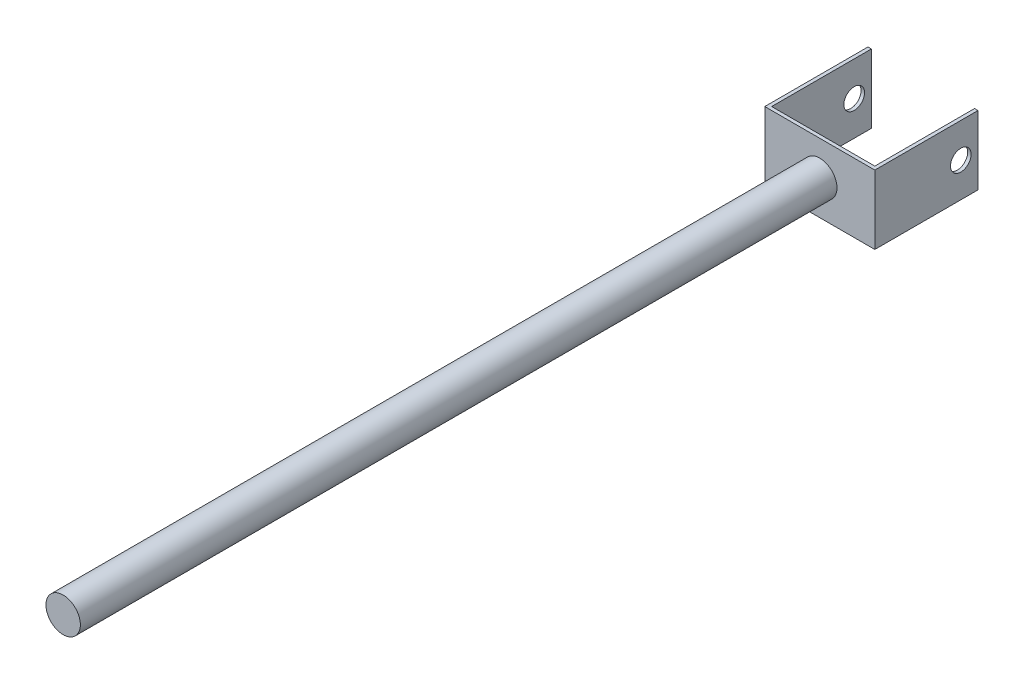
ISO-10303-21;
HEADER;
FILE_DESCRIPTION(('STEP AP214'),'2;1');
FILE_NAME('part.step','',(''),(''),'','','');
FILE_SCHEMA(('AUTOMOTIVE_DESIGN { 1 0 10303 214 1 1 1 1 }'));
ENDSEC;
DATA;
#1=APPLICATION_CONTEXT('core data for automotive mechanical design processes');
#2=APPLICATION_PROTOCOL_DEFINITION('international standard','automotive_design',2000,#1);
#3=PRODUCT_CONTEXT('',#1,'mechanical');
#4=PRODUCT('Part','Part','',(#3));
#5=PRODUCT_RELATED_PRODUCT_CATEGORY('part','',(#4));
#6=PRODUCT_DEFINITION_FORMATION('','',#4);
#7=PRODUCT_DEFINITION_CONTEXT('part definition',#1,'design');
#8=PRODUCT_DEFINITION('design','',#6,#7);
#9=PRODUCT_DEFINITION_SHAPE('','',#8);
#10=(LENGTH_UNIT() NAMED_UNIT(*) SI_UNIT(.MILLI.,.METRE.));
#11=(NAMED_UNIT(*) PLANE_ANGLE_UNIT() SI_UNIT($,.RADIAN.));
#12=(NAMED_UNIT(*) SI_UNIT($,.STERADIAN.) SOLID_ANGLE_UNIT());
#13=UNCERTAINTY_MEASURE_WITH_UNIT(LENGTH_MEASURE(1.E-05),#10,'distance_accuracy_value','');
#14=(GEOMETRIC_REPRESENTATION_CONTEXT(3) GLOBAL_UNCERTAINTY_ASSIGNED_CONTEXT((#13)) GLOBAL_UNIT_ASSIGNED_CONTEXT((#10,
#11,#12)) REPRESENTATION_CONTEXT('',''));
#15=CARTESIAN_POINT('',(0.,0.,0.));
#16=DIRECTION('',(0.,0.,1.));
#17=DIRECTION('',(1.,0.,0.));
#18=AXIS2_PLACEMENT_3D('',#15,#16,#17);
#19=CARTESIAN_POINT('',(80.,50.,-150.));
#20=DIRECTION('',(-1.,0.,0.));
#21=DIRECTION('',(0.,0.,1.));
#22=AXIS2_PLACEMENT_3D('',#19,#20,#21);
#23=PLANE('',#22);
#24=CARTESIAN_POINT('',(80.,0.,-125.));
#25=DIRECTION('',(1.,0.,0.));
#26=DIRECTION('',(0.,0.,-1.));
#27=AXIS2_PLACEMENT_3D('',#24,#25,#26);
#28=CIRCLE('',#27,15.);
#29=CARTESIAN_POINT('',(80.,0.,-140.));
#30=VERTEX_POINT('',#29);
#31=EDGE_CURVE('E231',#30,#30,#28,.T.);
#32=ORIENTED_EDGE('',*,*,#31,.F.);
#33=EDGE_LOOP('',(#32));
#34=FACE_BOUND('',#33,.T.);
#35=DIRECTION('',(0.,0.,-1.));
#36=VECTOR('',#35,1.);
#37=CARTESIAN_POINT('',(80.,-50.,-150.));
#38=LINE('',#37,#36);
#39=CARTESIAN_POINT('',(80.,-50.,0.));
#40=VERTEX_POINT('',#39);
#41=CARTESIAN_POINT('',(80.,-50.,-150.));
#42=VERTEX_POINT('',#41);
#43=EDGE_CURVE('E152',#40,#42,#38,.T.);
#44=ORIENTED_EDGE('',*,*,#43,.T.);
#45=DIRECTION('',(0.,-1.,0.));
#46=VECTOR('',#45,1.);
#47=CARTESIAN_POINT('',(80.,50.,-150.));
#48=LINE('',#47,#46);
#49=CARTESIAN_POINT('',(80.,50.,-150.));
#50=VERTEX_POINT('',#49);
#51=EDGE_CURVE('E187',#50,#42,#48,.T.);
#52=ORIENTED_EDGE('',*,*,#51,.F.);
#53=DIRECTION('',(0.,0.,-1.));
#54=VECTOR('',#53,1.);
#55=CARTESIAN_POINT('',(80.,50.,-150.));
#56=LINE('',#55,#54);
#57=CARTESIAN_POINT('',(80.,50.,0.));
#58=VERTEX_POINT('',#57);
#59=EDGE_CURVE('E108',#58,#50,#56,.T.);
#60=ORIENTED_EDGE('',*,*,#59,.F.);
#61=DIRECTION('',(0.,-1.,0.));
#62=VECTOR('',#61,1.);
#63=CARTESIAN_POINT('',(80.,50.,0.));
#64=LINE('',#63,#62);
#65=EDGE_CURVE('E48',#58,#40,#64,.T.);
#66=ORIENTED_EDGE('',*,*,#65,.T.);
#67=EDGE_LOOP('',(#44,#52,#60,#66));
#68=FACE_BOUND('',#67,.T.);
#69=ADVANCED_FACE('F45',(#34,#68),#23,.F.);
#70=CARTESIAN_POINT('',(75.,50.,-150.));
#71=DIRECTION('',(0.,0.,1.));
#72=DIRECTION('',(1.,0.,0.));
#73=AXIS2_PLACEMENT_3D('',#70,#71,#72);
#74=PLANE('',#73);
#75=DIRECTION('',(-1.,0.,0.));
#76=VECTOR('',#75,1.);
#77=CARTESIAN_POINT('',(75.,-50.,-150.));
#78=LINE('',#77,#76);
#79=CARTESIAN_POINT('',(75.,-50.,-150.));
#80=VERTEX_POINT('',#79);
#81=EDGE_CURVE('E155',#42,#80,#78,.T.);
#82=ORIENTED_EDGE('',*,*,#81,.T.);
#83=DIRECTION('',(0.,-1.,0.));
#84=VECTOR('',#83,1.);
#85=CARTESIAN_POINT('',(75.,50.,-150.));
#86=LINE('',#85,#84);
#87=CARTESIAN_POINT('',(75.,50.,-150.));
#88=VERTEX_POINT('',#87);
#89=EDGE_CURVE('E184',#88,#80,#86,.T.);
#90=ORIENTED_EDGE('',*,*,#89,.F.);
#91=DIRECTION('',(-1.,0.,0.));
#92=VECTOR('',#91,1.);
#93=CARTESIAN_POINT('',(75.,50.,-150.));
#94=LINE('',#93,#92);
#95=EDGE_CURVE('E209',#50,#88,#94,.T.);
#96=ORIENTED_EDGE('',*,*,#95,.F.);
#97=ORIENTED_EDGE('',*,*,#51,.T.);
#98=EDGE_LOOP('',(#82,#90,#96,#97));
#99=FACE_BOUND('',#98,.T.);
#100=ADVANCED_FACE('F202',(#99),#74,.F.);
#101=CARTESIAN_POINT('',(75.,50.,-4.99999999999998));
#102=DIRECTION('',(1.,0.,0.));
#103=DIRECTION('',(0.,0.,-1.));
#104=AXIS2_PLACEMENT_3D('',#101,#102,#103);
#105=PLANE('',#104);
#106=CARTESIAN_POINT('',(75.,0.,-125.));
#107=DIRECTION('',(1.,0.,0.));
#108=DIRECTION('',(0.,0.,-1.));
#109=AXIS2_PLACEMENT_3D('',#106,#107,#108);
#110=CIRCLE('',#109,15.);
#111=CARTESIAN_POINT('',(75.,0.,-140.));
#112=VERTEX_POINT('',#111);
#113=EDGE_CURVE('E222',#112,#112,#110,.T.);
#114=ORIENTED_EDGE('',*,*,#113,.T.);
#115=EDGE_LOOP('',(#114));
#116=FACE_BOUND('',#115,.T.);
#117=DIRECTION('',(0.,0.,1.));
#118=VECTOR('',#117,1.);
#119=CARTESIAN_POINT('',(75.,-50.,-4.99999999999998));
#120=LINE('',#119,#118);
#121=CARTESIAN_POINT('',(75.,-50.,-4.99999999999998));
#122=VERTEX_POINT('',#121);
#123=EDGE_CURVE('E159',#80,#122,#120,.T.);
#124=ORIENTED_EDGE('',*,*,#123,.T.);
#125=DIRECTION('',(0.,-1.,0.));
#126=VECTOR('',#125,1.);
#127=CARTESIAN_POINT('',(75.,50.,-4.99999999999998));
#128=LINE('',#127,#126);
#129=CARTESIAN_POINT('',(75.,50.,-4.99999999999998));
#130=VERTEX_POINT('',#129);
#131=EDGE_CURVE('E180',#130,#122,#128,.T.);
#132=ORIENTED_EDGE('',*,*,#131,.F.);
#133=DIRECTION('',(0.,0.,1.));
#134=VECTOR('',#133,1.);
#135=CARTESIAN_POINT('',(75.,50.,-4.99999999999998));
#136=LINE('',#135,#134);
#137=EDGE_CURVE('E207',#88,#130,#136,.T.);
#138=ORIENTED_EDGE('',*,*,#137,.F.);
#139=ORIENTED_EDGE('',*,*,#89,.T.);
#140=EDGE_LOOP('',(#124,#132,#138,#139));
#141=FACE_BOUND('',#140,.T.);
#142=ADVANCED_FACE('F205',(#116,#141),#105,.F.);
#143=CARTESIAN_POINT('',(-75.,50.,-4.99999999999998));
#144=DIRECTION('',(0.,0.,1.));
#145=DIRECTION('',(1.,0.,0.));
#146=AXIS2_PLACEMENT_3D('',#143,#144,#145);
#147=PLANE('',#146);
#148=DIRECTION('',(-1.,0.,0.));
#149=VECTOR('',#148,1.);
#150=CARTESIAN_POINT('',(-75.,-50.,-4.99999999999998));
#151=LINE('',#150,#149);
#152=CARTESIAN_POINT('',(-75.,-50.,-4.99999999999998));
#153=VERTEX_POINT('',#152);
#154=EDGE_CURVE('E162',#122,#153,#151,.T.);
#155=ORIENTED_EDGE('',*,*,#154,.T.);
#156=DIRECTION('',(0.,-1.,0.));
#157=VECTOR('',#156,1.);
#158=CARTESIAN_POINT('',(-75.,50.,-4.99999999999998));
#159=LINE('',#158,#157);
#160=CARTESIAN_POINT('',(-75.,50.,-4.99999999999998));
#161=VERTEX_POINT('',#160);
#162=EDGE_CURVE('E139',#161,#153,#159,.T.);
#163=ORIENTED_EDGE('',*,*,#162,.F.);
#164=DIRECTION('',(-1.,0.,0.));
#165=VECTOR('',#164,1.);
#166=CARTESIAN_POINT('',(-75.,50.,-4.99999999999998));
#167=LINE('',#166,#165);
#168=EDGE_CURVE('E128',#130,#161,#167,.T.);
#169=ORIENTED_EDGE('',*,*,#168,.F.);
#170=ORIENTED_EDGE('',*,*,#131,.T.);
#171=EDGE_LOOP('',(#155,#163,#169,#170));
#172=FACE_BOUND('',#171,.T.);
#173=ADVANCED_FACE('F250',(#172),#147,.F.);
#174=CARTESIAN_POINT('',(-75.,50.,-150.));
#175=DIRECTION('',(-1.,0.,0.));
#176=DIRECTION('',(0.,0.,1.));
#177=AXIS2_PLACEMENT_3D('',#174,#175,#176);
#178=PLANE('',#177);
#179=CARTESIAN_POINT('',(-75.,0.,-125.));
#180=DIRECTION('',(-1.,0.,0.));
#181=DIRECTION('',(0.,0.,1.));
#182=AXIS2_PLACEMENT_3D('',#179,#180,#181);
#183=CIRCLE('',#182,15.);
#184=CARTESIAN_POINT('',(-75.,0.,-110.));
#185=VERTEX_POINT('',#184);
#186=EDGE_CURVE('E226',#185,#185,#183,.T.);
#187=ORIENTED_EDGE('',*,*,#186,.T.);
#188=EDGE_LOOP('',(#187));
#189=FACE_BOUND('',#188,.T.);
#190=DIRECTION('',(0.,0.,-1.));
#191=VECTOR('',#190,1.);
#192=CARTESIAN_POINT('',(-75.,-50.,-150.));
#193=LINE('',#192,#191);
#194=CARTESIAN_POINT('',(-75.,-50.,-150.));
#195=VERTEX_POINT('',#194);
#196=EDGE_CURVE('E137',#153,#195,#193,.T.);
#197=ORIENTED_EDGE('',*,*,#196,.T.);
#198=DIRECTION('',(0.,-1.,0.));
#199=VECTOR('',#198,1.);
#200=CARTESIAN_POINT('',(-75.,50.,-150.));
#201=LINE('',#200,#199);
#202=CARTESIAN_POINT('',(-75.,50.,-150.));
#203=VERTEX_POINT('',#202);
#204=EDGE_CURVE('E134',#203,#195,#201,.T.);
#205=ORIENTED_EDGE('',*,*,#204,.F.);
#206=DIRECTION('',(0.,0.,-1.));
#207=VECTOR('',#206,1.);
#208=CARTESIAN_POINT('',(-75.,50.,-150.));
#209=LINE('',#208,#207);
#210=EDGE_CURVE('E122',#161,#203,#209,.T.);
#211=ORIENTED_EDGE('',*,*,#210,.F.);
#212=ORIENTED_EDGE('',*,*,#162,.T.);
#213=EDGE_LOOP('',(#197,#205,#211,#212));
#214=FACE_BOUND('',#213,.T.);
#215=ADVANCED_FACE('F135',(#189,#214),#178,.F.);
#216=CARTESIAN_POINT('',(-80.,50.,-150.));
#217=DIRECTION('',(0.,0.,1.));
#218=DIRECTION('',(1.,0.,0.));
#219=AXIS2_PLACEMENT_3D('',#216,#217,#218);
#220=PLANE('',#219);
#221=DIRECTION('',(-1.,0.,0.));
#222=VECTOR('',#221,1.);
#223=CARTESIAN_POINT('',(-80.,-50.,-150.));
#224=LINE('',#223,#222);
#225=CARTESIAN_POINT('',(-80.,-50.,-150.));
#226=VERTEX_POINT('',#225);
#227=EDGE_CURVE('E93',#195,#226,#224,.T.);
#228=ORIENTED_EDGE('',*,*,#227,.T.);
#229=DIRECTION('',(0.,-1.,0.));
#230=VECTOR('',#229,1.);
#231=CARTESIAN_POINT('',(-80.,50.,-150.));
#232=LINE('',#231,#230);
#233=CARTESIAN_POINT('',(-80.,50.,-150.));
#234=VERTEX_POINT('',#233);
#235=EDGE_CURVE('E140',#234,#226,#232,.T.);
#236=ORIENTED_EDGE('',*,*,#235,.F.);
#237=DIRECTION('',(-1.,0.,0.));
#238=VECTOR('',#237,1.);
#239=CARTESIAN_POINT('',(-80.,50.,-150.));
#240=LINE('',#239,#238);
#241=EDGE_CURVE('E126',#203,#234,#240,.T.);
#242=ORIENTED_EDGE('',*,*,#241,.F.);
#243=ORIENTED_EDGE('',*,*,#204,.T.);
#244=EDGE_LOOP('',(#228,#236,#242,#243));
#245=FACE_BOUND('',#244,.T.);
#246=ADVANCED_FACE('F142',(#245),#220,.F.);
#247=CARTESIAN_POINT('',(-80.,50.,0.));
#248=DIRECTION('',(1.,0.,0.));
#249=DIRECTION('',(0.,0.,-1.));
#250=AXIS2_PLACEMENT_3D('',#247,#248,#249);
#251=PLANE('',#250);
#252=CARTESIAN_POINT('',(-80.0000000000001,0.,-125.));
#253=DIRECTION('',(1.,0.,0.));
#254=DIRECTION('',(0.,0.,-1.));
#255=AXIS2_PLACEMENT_3D('',#252,#253,#254);
#256=CIRCLE('',#255,15.);
#257=CARTESIAN_POINT('',(-80.0000000000001,0.,-140.));
#258=VERTEX_POINT('',#257);
#259=EDGE_CURVE('E230',#258,#258,#256,.T.);
#260=ORIENTED_EDGE('',*,*,#259,.T.);
#261=EDGE_LOOP('',(#260));
#262=FACE_BOUND('',#261,.T.);
#263=DIRECTION('',(0.,0.,1.));
#264=VECTOR('',#263,1.);
#265=CARTESIAN_POINT('',(-80.,-50.,0.));
#266=LINE('',#265,#264);
#267=CARTESIAN_POINT('',(-80.,-50.,0.));
#268=VERTEX_POINT('',#267);
#269=EDGE_CURVE('E100',#226,#268,#266,.T.);
#270=ORIENTED_EDGE('',*,*,#269,.T.);
#271=DIRECTION('',(0.,-1.,0.));
#272=VECTOR('',#271,1.);
#273=CARTESIAN_POINT('',(-80.,50.,0.));
#274=LINE('',#273,#272);
#275=CARTESIAN_POINT('',(-80.,50.,0.));
#276=VERTEX_POINT('',#275);
#277=EDGE_CURVE('E148',#276,#268,#274,.T.);
#278=ORIENTED_EDGE('',*,*,#277,.F.);
#279=DIRECTION('',(0.,0.,1.));
#280=VECTOR('',#279,1.);
#281=CARTESIAN_POINT('',(-80.,50.,0.));
#282=LINE('',#281,#280);
#283=EDGE_CURVE('E145',#234,#276,#282,.T.);
#284=ORIENTED_EDGE('',*,*,#283,.F.);
#285=ORIENTED_EDGE('',*,*,#235,.T.);
#286=EDGE_LOOP('',(#270,#278,#284,#285));
#287=FACE_BOUND('',#286,.T.);
#288=ADVANCED_FACE('F239',(#262,#287),#251,.F.);
#289=CARTESIAN_POINT('',(0.,50.,0.));
#290=DIRECTION('',(0.,0.,-1.));
#291=DIRECTION('',(-1.,0.,0.));
#292=AXIS2_PLACEMENT_3D('',#289,#290,#291);
#293=PLANE('',#292);
#294=CARTESIAN_POINT('',(0.,0.,0.));
#295=DIRECTION('',(0.,0.,1.));
#296=DIRECTION('',(1.,0.,0.));
#297=AXIS2_PLACEMENT_3D('',#294,#295,#296);
#298=CIRCLE('',#297,25.);
#299=CARTESIAN_POINT('',(25.,0.,0.));
#300=VERTEX_POINT('',#299);
#301=EDGE_CURVE('E11',#300,#300,#298,.T.);
#302=ORIENTED_EDGE('',*,*,#301,.F.);
#303=EDGE_LOOP('',(#302));
#304=FACE_BOUND('',#303,.T.);
#305=DIRECTION('',(1.,0.,0.));
#306=VECTOR('',#305,1.);
#307=CARTESIAN_POINT('',(0.,-50.,0.));
#308=LINE('',#307,#306);
#309=EDGE_CURVE('E171',#268,#40,#308,.T.);
#310=ORIENTED_EDGE('',*,*,#309,.T.);
#311=ORIENTED_EDGE('',*,*,#65,.F.);
#312=DIRECTION('',(1.,0.,0.));
#313=VECTOR('',#312,1.);
#314=CARTESIAN_POINT('',(80.,50.,0.));
#315=LINE('',#314,#313);
#316=EDGE_CURVE('E63',#276,#58,#315,.T.);
#317=ORIENTED_EDGE('',*,*,#316,.F.);
#318=ORIENTED_EDGE('',*,*,#277,.T.);
#319=EDGE_LOOP('',(#310,#311,#317,#318));
#320=FACE_BOUND('',#319,.T.);
#321=ADVANCED_FACE('F195',(#304,#320),#293,.F.);
#322=CARTESIAN_POINT('',(0.,50.,0.));
#323=DIRECTION('',(0.,-1.,0.));
#324=DIRECTION('',(0.,0.,-1.));
#325=AXIS2_PLACEMENT_3D('',#322,#323,#324);
#326=PLANE('',#325);
#327=ORIENTED_EDGE('',*,*,#316,.T.);
#328=ORIENTED_EDGE('',*,*,#59,.T.);
#329=ORIENTED_EDGE('',*,*,#95,.T.);
#330=ORIENTED_EDGE('',*,*,#137,.T.);
#331=ORIENTED_EDGE('',*,*,#168,.T.);
#332=ORIENTED_EDGE('',*,*,#210,.T.);
#333=ORIENTED_EDGE('',*,*,#241,.T.);
#334=ORIENTED_EDGE('',*,*,#283,.T.);
#335=EDGE_LOOP('',(#327,#328,#329,#330,#331,#332,#333,#334));
#336=FACE_BOUND('',#335,.T.);
#337=ADVANCED_FACE('F124',(#336),#326,.F.);
#338=CARTESIAN_POINT('',(0.,-50.,0.));
#339=DIRECTION('',(0.,-1.,0.));
#340=DIRECTION('',(0.,0.,-1.));
#341=AXIS2_PLACEMENT_3D('',#338,#339,#340);
#342=PLANE('',#341);
#343=ORIENTED_EDGE('',*,*,#43,.F.);
#344=ORIENTED_EDGE('',*,*,#309,.F.);
#345=ORIENTED_EDGE('',*,*,#269,.F.);
#346=ORIENTED_EDGE('',*,*,#227,.F.);
#347=ORIENTED_EDGE('',*,*,#196,.F.);
#348=ORIENTED_EDGE('',*,*,#154,.F.);
#349=ORIENTED_EDGE('',*,*,#123,.F.);
#350=ORIENTED_EDGE('',*,*,#81,.F.);
#351=EDGE_LOOP('',(#343,#344,#345,#346,#347,#348,#349,#350));
#352=FACE_BOUND('',#351,.T.);
#353=ADVANCED_FACE('F198',(#352),#342,.T.);
#354=CARTESIAN_POINT('',(0.,0.,1100.));
#355=DIRECTION('',(0.,0.,-1.));
#356=DIRECTION('',(-1.,0.,0.));
#357=AXIS2_PLACEMENT_3D('',#354,#355,#356);
#358=CYLINDRICAL_SURFACE('',#357,25.);
#359=CARTESIAN_POINT('',(0.,0.,1100.));
#360=DIRECTION('',(0.,0.,1.));
#361=DIRECTION('',(1.,0.,0.));
#362=AXIS2_PLACEMENT_3D('',#359,#360,#361);
#363=CIRCLE('',#362,25.);
#364=CARTESIAN_POINT('',(25.,0.,1100.));
#365=VERTEX_POINT('',#364);
#366=EDGE_CURVE('E156',#365,#365,#363,.T.);
#367=ORIENTED_EDGE('',*,*,#366,.F.);
#368=EDGE_LOOP('',(#367));
#369=FACE_BOUND('',#368,.T.);
#370=ORIENTED_EDGE('',*,*,#301,.T.);
#371=EDGE_LOOP('',(#370));
#372=FACE_BOUND('',#371,.T.);
#373=ADVANCED_FACE('F334',(#369,#372),#358,.T.);
#374=CARTESIAN_POINT('',(0.,0.,1100.));
#375=DIRECTION('',(0.,0.,1.));
#376=DIRECTION('',(1.,0.,0.));
#377=AXIS2_PLACEMENT_3D('',#374,#375,#376);
#378=PLANE('',#377);
#379=ORIENTED_EDGE('',*,*,#366,.T.);
#380=EDGE_LOOP('',(#379));
#381=FACE_BOUND('',#380,.T.);
#382=ADVANCED_FACE('F245',(#381),#378,.T.);
#383=CARTESIAN_POINT('',(-80.0000000000001,0.,-125.));
#384=DIRECTION('',(1.,0.,0.));
#385=DIRECTION('',(0.,0.,-1.));
#386=AXIS2_PLACEMENT_3D('',#383,#384,#385);
#387=CYLINDRICAL_SURFACE('',#386,15.);
#388=ORIENTED_EDGE('',*,*,#259,.F.);
#389=EDGE_LOOP('',(#388));
#390=FACE_BOUND('',#389,.T.);
#391=ORIENTED_EDGE('',*,*,#186,.F.);
#392=EDGE_LOOP('',(#391));
#393=FACE_BOUND('',#392,.T.);
#394=ADVANCED_FACE('F241',(#390,#393),#387,.F.);
#395=ORIENTED_EDGE('',*,*,#31,.T.);
#396=EDGE_LOOP('',(#395));
#397=FACE_BOUND('',#396,.T.);
#398=ORIENTED_EDGE('',*,*,#113,.F.);
#399=EDGE_LOOP('',(#398));
#400=FACE_BOUND('',#399,.T.);
#401=ADVANCED_FACE('F244',(#397,#400),#387,.F.);
#402=CLOSED_SHELL('',(#69,#100,#142,#173,#215,#246,#288,#321,#337,#353,#373,#382,#394,#401));
#403=MANIFOLD_SOLID_BREP('B2',#402);
#404=ADVANCED_BREP_SHAPE_REPRESENTATION('',(#18,#403),#14);
#405=SHAPE_DEFINITION_REPRESENTATION(#9,#404);
ENDSEC;
END-ISO-10303-21;
